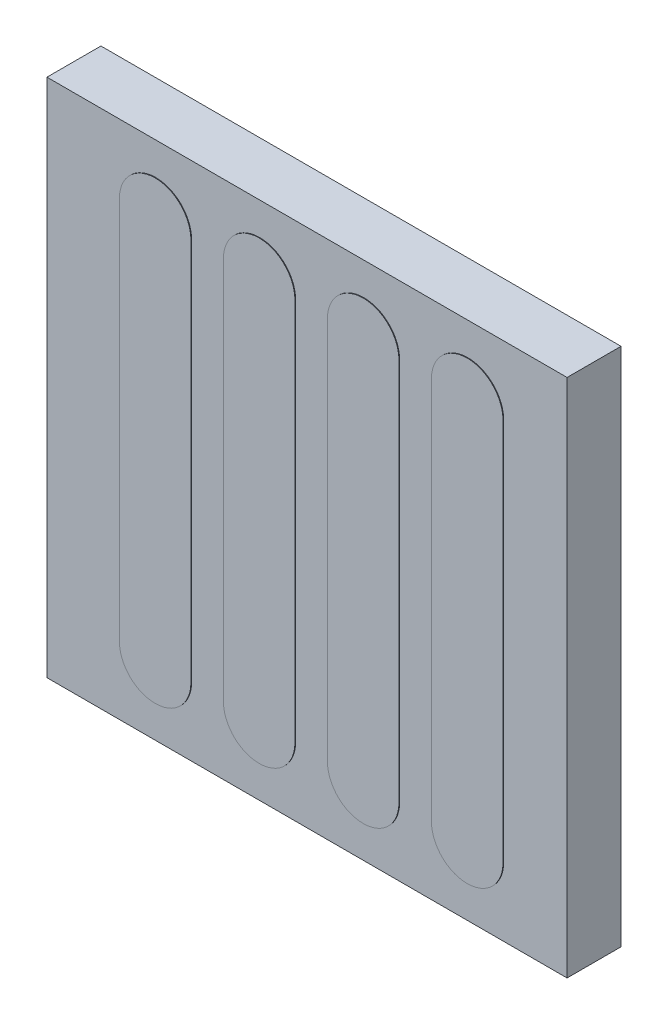
ISO-10303-21;
HEADER;
FILE_DESCRIPTION(('STEP AP214'),'2;1');
FILE_NAME('part.step','',(''),(''),'','','');
FILE_SCHEMA(('AUTOMOTIVE_DESIGN { 1 0 10303 214 1 1 1 1 }'));
ENDSEC;
DATA;
#1=APPLICATION_CONTEXT('core data for automotive mechanical design processes');
#2=APPLICATION_PROTOCOL_DEFINITION('international standard','automotive_design',2000,#1);
#3=PRODUCT_CONTEXT('',#1,'mechanical');
#4=PRODUCT('Part','Part','',(#3));
#5=PRODUCT_RELATED_PRODUCT_CATEGORY('part','',(#4));
#6=PRODUCT_DEFINITION_FORMATION('','',#4);
#7=PRODUCT_DEFINITION_CONTEXT('part definition',#1,'design');
#8=PRODUCT_DEFINITION('design','',#6,#7);
#9=PRODUCT_DEFINITION_SHAPE('','',#8);
#10=(LENGTH_UNIT() NAMED_UNIT(*) SI_UNIT(.MILLI.,.METRE.));
#11=(NAMED_UNIT(*) PLANE_ANGLE_UNIT() SI_UNIT($,.RADIAN.));
#12=(NAMED_UNIT(*) SI_UNIT($,.STERADIAN.) SOLID_ANGLE_UNIT());
#13=UNCERTAINTY_MEASURE_WITH_UNIT(LENGTH_MEASURE(1.E-05),#10,'distance_accuracy_value','');
#14=(GEOMETRIC_REPRESENTATION_CONTEXT(3) GLOBAL_UNCERTAINTY_ASSIGNED_CONTEXT((#13)) GLOBAL_UNIT_ASSIGNED_CONTEXT((#10,
#11,#12)) REPRESENTATION_CONTEXT('',''));
#15=CARTESIAN_POINT('',(0.,0.,0.));
#16=DIRECTION('',(0.,0.,1.));
#17=DIRECTION('',(1.,0.,0.));
#18=AXIS2_PLACEMENT_3D('',#15,#16,#17);
#19=CARTESIAN_POINT('',(0.,0.,4.15));
#20=DIRECTION('',(0.,0.,1.));
#21=DIRECTION('',(1.,0.,0.));
#22=AXIS2_PLACEMENT_3D('',#19,#20,#21);
#23=PLANE('',#22);
#24=DIRECTION('',(0.,1.,0.));
#25=VECTOR('',#24,1.);
#26=CARTESIAN_POINT('',(-0.879724952684046,0.,4.15));
#27=LINE('',#26,#25);
#28=CARTESIAN_POINT('',(-0.879724952684045,-14.75,4.15));
#29=VERTEX_POINT('',#28);
#30=CARTESIAN_POINT('',(-0.879724952684045,14.75,4.15));
#31=VERTEX_POINT('',#30);
#32=EDGE_CURVE('E179',#29,#31,#27,.T.);
#33=ORIENTED_EDGE('',*,*,#32,.F.);
#34=CARTESIAN_POINT('',(-3.62972495268405,-14.75,4.15));
#35=DIRECTION('',(0.,0.,1.));
#36=DIRECTION('',(1.,0.,0.));
#37=AXIS2_PLACEMENT_3D('',#34,#35,#36);
#38=CIRCLE('',#37,2.75000000000001);
#39=CARTESIAN_POINT('',(-6.37972495268406,-14.75,4.15));
#40=VERTEX_POINT('',#39);
#41=EDGE_CURVE('E196',#29,#40,#38,.F.);
#42=ORIENTED_EDGE('',*,*,#41,.T.);
#43=DIRECTION('',(0.,1.,0.));
#44=VECTOR('',#43,1.);
#45=CARTESIAN_POINT('',(-6.37972495268406,0.,4.15));
#46=LINE('',#45,#44);
#47=CARTESIAN_POINT('',(-6.37972495268406,14.75,4.15));
#48=VERTEX_POINT('',#47);
#49=EDGE_CURVE('E199',#40,#48,#46,.T.);
#50=ORIENTED_EDGE('',*,*,#49,.T.);
#51=CARTESIAN_POINT('',(-3.62972495268405,14.75,4.15));
#52=DIRECTION('',(0.,0.,1.));
#53=DIRECTION('',(1.,0.,0.));
#54=AXIS2_PLACEMENT_3D('',#51,#52,#53);
#55=CIRCLE('',#54,2.75000000000001);
#56=EDGE_CURVE('E206',#48,#31,#55,.F.);
#57=ORIENTED_EDGE('',*,*,#56,.T.);
#58=EDGE_LOOP('',(#33,#42,#50,#57));
#59=FACE_BOUND('',#58,.T.);
#60=DIRECTION('',(0.,1.,0.));
#61=VECTOR('',#60,1.);
#62=CARTESIAN_POINT('',(7.12027504731595,0.,4.15));
#63=LINE('',#62,#61);
#64=CARTESIAN_POINT('',(7.12027504731595,-14.75,4.15));
#65=VERTEX_POINT('',#64);
#66=CARTESIAN_POINT('',(7.12027504731595,14.75,4.15));
#67=VERTEX_POINT('',#66);
#68=EDGE_CURVE('E237',#65,#67,#63,.T.);
#69=ORIENTED_EDGE('',*,*,#68,.F.);
#70=CARTESIAN_POINT('',(4.37027504731595,-14.75,4.15));
#71=DIRECTION('',(0.,0.,1.));
#72=DIRECTION('',(1.,0.,0.));
#73=AXIS2_PLACEMENT_3D('',#70,#71,#72);
#74=CIRCLE('',#73,2.75);
#75=CARTESIAN_POINT('',(1.62027504731595,-14.75,4.15));
#76=VERTEX_POINT('',#75);
#77=EDGE_CURVE('E228',#65,#76,#74,.F.);
#78=ORIENTED_EDGE('',*,*,#77,.T.);
#79=DIRECTION('',(0.,1.,0.));
#80=VECTOR('',#79,1.);
#81=CARTESIAN_POINT('',(1.62027504731595,0.,4.15));
#82=LINE('',#81,#80);
#83=CARTESIAN_POINT('',(1.62027504731595,14.75,4.15));
#84=VERTEX_POINT('',#83);
#85=EDGE_CURVE('E231',#76,#84,#82,.T.);
#86=ORIENTED_EDGE('',*,*,#85,.T.);
#87=CARTESIAN_POINT('',(4.37027504731595,14.75,4.15));
#88=DIRECTION('',(0.,0.,1.));
#89=DIRECTION('',(1.,0.,0.));
#90=AXIS2_PLACEMENT_3D('',#87,#88,#89);
#91=CIRCLE('',#90,2.75);
#92=EDGE_CURVE('E234',#84,#67,#91,.F.);
#93=ORIENTED_EDGE('',*,*,#92,.T.);
#94=EDGE_LOOP('',(#69,#78,#86,#93));
#95=FACE_BOUND('',#94,.T.);
#96=DIRECTION('',(0.,-1.,0.));
#97=VECTOR('',#96,1.);
#98=CARTESIAN_POINT('',(9.62027504731594,0.,4.15));
#99=LINE('',#98,#97);
#100=CARTESIAN_POINT('',(9.62027504731594,14.75,4.15));
#101=VERTEX_POINT('',#100);
#102=CARTESIAN_POINT('',(9.62027504731594,-14.75,4.15));
#103=VERTEX_POINT('',#102);
#104=EDGE_CURVE('E307',#101,#103,#99,.T.);
#105=ORIENTED_EDGE('',*,*,#104,.F.);
#106=CARTESIAN_POINT('',(12.3702750473159,14.75,4.15));
#107=DIRECTION('',(0.,0.,1.));
#108=DIRECTION('',(1.,0.,0.));
#109=AXIS2_PLACEMENT_3D('',#106,#107,#108);
#110=CIRCLE('',#109,2.75000000000001);
#111=CARTESIAN_POINT('',(15.120275047316,14.75,4.15));
#112=VERTEX_POINT('',#111);
#113=EDGE_CURVE('E11',#112,#101,#110,.T.);
#114=ORIENTED_EDGE('',*,*,#113,.F.);
#115=DIRECTION('',(0.,-1.,0.));
#116=VECTOR('',#115,1.);
#117=CARTESIAN_POINT('',(15.120275047316,0.,4.15));
#118=LINE('',#117,#116);
#119=CARTESIAN_POINT('',(15.120275047316,-14.75,4.15));
#120=VERTEX_POINT('',#119);
#121=EDGE_CURVE('E302',#112,#120,#118,.T.);
#122=ORIENTED_EDGE('',*,*,#121,.T.);
#123=CARTESIAN_POINT('',(12.3702750473159,-14.75,4.15));
#124=DIRECTION('',(0.,0.,1.));
#125=DIRECTION('',(1.,0.,0.));
#126=AXIS2_PLACEMENT_3D('',#123,#124,#125);
#127=CIRCLE('',#126,2.75000000000001);
#128=EDGE_CURVE('E304',#103,#120,#127,.T.);
#129=ORIENTED_EDGE('',*,*,#128,.F.);
#130=EDGE_LOOP('',(#105,#114,#122,#129));
#131=FACE_BOUND('',#130,.T.);
#132=DIRECTION('',(0.,1.,0.));
#133=VECTOR('',#132,1.);
#134=CARTESIAN_POINT('',(20.,20.,4.15));
#135=LINE('',#134,#133);
#136=CARTESIAN_POINT('',(20.,-20.,4.15));
#137=VERTEX_POINT('',#136);
#138=CARTESIAN_POINT('',(20.,20.,4.15));
#139=VERTEX_POINT('',#138);
#140=EDGE_CURVE('E273',#137,#139,#135,.T.);
#141=ORIENTED_EDGE('',*,*,#140,.T.);
#142=DIRECTION('',(-1.,0.,0.));
#143=VECTOR('',#142,1.);
#144=CARTESIAN_POINT('',(-20.,20.,4.15));
#145=LINE('',#144,#143);
#146=CARTESIAN_POINT('',(-20.,20.,4.15));
#147=VERTEX_POINT('',#146);
#148=EDGE_CURVE('E276',#139,#147,#145,.T.);
#149=ORIENTED_EDGE('',*,*,#148,.T.);
#150=DIRECTION('',(0.,-1.,0.));
#151=VECTOR('',#150,1.);
#152=CARTESIAN_POINT('',(-20.,20.,4.15));
#153=LINE('',#152,#151);
#154=CARTESIAN_POINT('',(-20.,-20.,4.15));
#155=VERTEX_POINT('',#154);
#156=EDGE_CURVE('E279',#147,#155,#153,.T.);
#157=ORIENTED_EDGE('',*,*,#156,.T.);
#158=DIRECTION('',(1.,0.,0.));
#159=VECTOR('',#158,1.);
#160=CARTESIAN_POINT('',(-20.,-20.,4.15));
#161=LINE('',#160,#159);
#162=EDGE_CURVE('E281',#155,#137,#161,.T.);
#163=ORIENTED_EDGE('',*,*,#162,.T.);
#164=EDGE_LOOP('',(#141,#149,#157,#163));
#165=FACE_BOUND('',#164,.T.);
#166=CARTESIAN_POINT('',(-11.6297249526841,-14.75,4.15));
#167=DIRECTION('',(0.,0.,1.));
#168=DIRECTION('',(1.,0.,0.));
#169=AXIS2_PLACEMENT_3D('',#166,#167,#168);
#170=CIRCLE('',#169,2.75000000000001);
#171=CARTESIAN_POINT('',(-8.87972495268404,-14.75,4.15));
#172=VERTEX_POINT('',#171);
#173=CARTESIAN_POINT('',(-14.3797249526841,-14.75,4.15));
#174=VERTEX_POINT('',#173);
#175=EDGE_CURVE('E266',#172,#174,#170,.F.);
#176=ORIENTED_EDGE('',*,*,#175,.T.);
#177=DIRECTION('',(0.,1.,0.));
#178=VECTOR('',#177,1.);
#179=CARTESIAN_POINT('',(-14.3797249526841,0.,4.15));
#180=LINE('',#179,#178);
#181=CARTESIAN_POINT('',(-14.3797249526841,14.75,4.15));
#182=VERTEX_POINT('',#181);
#183=EDGE_CURVE('E269',#174,#182,#180,.T.);
#184=ORIENTED_EDGE('',*,*,#183,.T.);
#185=CARTESIAN_POINT('',(-11.6297249526841,14.75,4.15));
#186=DIRECTION('',(0.,0.,1.));
#187=DIRECTION('',(1.,0.,0.));
#188=AXIS2_PLACEMENT_3D('',#185,#186,#187);
#189=CIRCLE('',#188,2.75000000000001);
#190=CARTESIAN_POINT('',(-8.87972495268404,14.75,4.15));
#191=VERTEX_POINT('',#190);
#192=EDGE_CURVE('E260',#182,#191,#189,.F.);
#193=ORIENTED_EDGE('',*,*,#192,.T.);
#194=DIRECTION('',(0.,1.,0.));
#195=VECTOR('',#194,1.);
#196=CARTESIAN_POINT('',(-8.87972495268405,0.,4.15));
#197=LINE('',#196,#195);
#198=EDGE_CURVE('E263',#172,#191,#197,.T.);
#199=ORIENTED_EDGE('',*,*,#198,.F.);
#200=EDGE_LOOP('',(#176,#184,#193,#199));
#201=FACE_BOUND('',#200,.T.);
#202=ADVANCED_FACE('F33',(#59,#95,#131,#165,#201),#23,.T.);
#203=CARTESIAN_POINT('',(9.62027504731594,0.,4.2));
#204=DIRECTION('',(1.,0.,0.));
#205=DIRECTION('',(0.,1.,0.));
#206=AXIS2_PLACEMENT_3D('',#203,#204,#205);
#207=PLANE('',#206);
#208=DIRECTION('',(0.,0.,-1.));
#209=VECTOR('',#208,1.);
#210=CARTESIAN_POINT('',(9.62027504731594,14.75,4.2));
#211=LINE('',#210,#209);
#212=CARTESIAN_POINT('',(9.62027504731594,14.75,4.2));
#213=VERTEX_POINT('',#212);
#214=EDGE_CURVE('E320',#213,#101,#211,.T.);
#215=ORIENTED_EDGE('',*,*,#214,.T.);
#216=ORIENTED_EDGE('',*,*,#104,.T.);
#217=DIRECTION('',(0.,0.,-1.));
#218=VECTOR('',#217,1.);
#219=CARTESIAN_POINT('',(9.62027504731594,-14.75,4.2));
#220=LINE('',#219,#218);
#221=CARTESIAN_POINT('',(9.62027504731594,-14.75,4.2));
#222=VERTEX_POINT('',#221);
#223=EDGE_CURVE('E41',#222,#103,#220,.T.);
#224=ORIENTED_EDGE('',*,*,#223,.F.);
#225=DIRECTION('',(0.,-1.,0.));
#226=VECTOR('',#225,1.);
#227=CARTESIAN_POINT('',(9.62027504731594,0.,4.2));
#228=LINE('',#227,#226);
#229=EDGE_CURVE('E310',#213,#222,#228,.T.);
#230=ORIENTED_EDGE('',*,*,#229,.F.);
#231=EDGE_LOOP('',(#215,#216,#224,#230));
#232=FACE_BOUND('',#231,.T.);
#233=ADVANCED_FACE('F35',(#232),#207,.F.);
#234=CARTESIAN_POINT('',(12.3702750473159,-14.75,4.2));
#235=DIRECTION('',(0.,0.,-1.));
#236=DIRECTION('',(-1.,0.,0.));
#237=AXIS2_PLACEMENT_3D('',#234,#235,#236);
#238=CYLINDRICAL_SURFACE('',#237,2.75000000000001);
#239=ORIENTED_EDGE('',*,*,#223,.T.);
#240=ORIENTED_EDGE('',*,*,#128,.T.);
#241=DIRECTION('',(0.,0.,-1.));
#242=VECTOR('',#241,1.);
#243=CARTESIAN_POINT('',(15.120275047316,-14.75,4.2));
#244=LINE('',#243,#242);
#245=CARTESIAN_POINT('',(15.120275047316,-14.75,4.2));
#246=VERTEX_POINT('',#245);
#247=EDGE_CURVE('E326',#246,#120,#244,.T.);
#248=ORIENTED_EDGE('',*,*,#247,.F.);
#249=CARTESIAN_POINT('',(12.3702750473159,-14.75,4.2));
#250=DIRECTION('',(0.,0.,1.));
#251=DIRECTION('',(1.,0.,0.));
#252=AXIS2_PLACEMENT_3D('',#249,#250,#251);
#253=CIRCLE('',#252,2.75000000000001);
#254=EDGE_CURVE('E313',#222,#246,#253,.T.);
#255=ORIENTED_EDGE('',*,*,#254,.F.);
#256=EDGE_LOOP('',(#239,#240,#248,#255));
#257=FACE_BOUND('',#256,.T.);
#258=ADVANCED_FACE('F331',(#257),#238,.T.);
#259=CARTESIAN_POINT('',(15.120275047316,0.,4.2));
#260=DIRECTION('',(1.,0.,0.));
#261=DIRECTION('',(0.,1.,0.));
#262=AXIS2_PLACEMENT_3D('',#259,#260,#261);
#263=PLANE('',#262);
#264=ORIENTED_EDGE('',*,*,#121,.F.);
#265=DIRECTION('',(0.,0.,-1.));
#266=VECTOR('',#265,1.);
#267=CARTESIAN_POINT('',(15.120275047316,14.75,4.2));
#268=LINE('',#267,#266);
#269=CARTESIAN_POINT('',(15.120275047316,14.75,4.2));
#270=VERTEX_POINT('',#269);
#271=EDGE_CURVE('E323',#270,#112,#268,.T.);
#272=ORIENTED_EDGE('',*,*,#271,.F.);
#273=DIRECTION('',(0.,-1.,0.));
#274=VECTOR('',#273,1.);
#275=CARTESIAN_POINT('',(15.120275047316,0.,4.2));
#276=LINE('',#275,#274);
#277=EDGE_CURVE('E315',#270,#246,#276,.T.);
#278=ORIENTED_EDGE('',*,*,#277,.T.);
#279=ORIENTED_EDGE('',*,*,#247,.T.);
#280=EDGE_LOOP('',(#264,#272,#278,#279));
#281=FACE_BOUND('',#280,.T.);
#282=ADVANCED_FACE('F344',(#281),#263,.T.);
#283=CARTESIAN_POINT('',(12.3702750473159,14.75,4.2));
#284=DIRECTION('',(0.,0.,-1.));
#285=DIRECTION('',(-1.,0.,0.));
#286=AXIS2_PLACEMENT_3D('',#283,#284,#285);
#287=CYLINDRICAL_SURFACE('',#286,2.75000000000001);
#288=ORIENTED_EDGE('',*,*,#271,.T.);
#289=ORIENTED_EDGE('',*,*,#113,.T.);
#290=ORIENTED_EDGE('',*,*,#214,.F.);
#291=CARTESIAN_POINT('',(12.3702750473159,14.75,4.2));
#292=DIRECTION('',(0.,0.,1.));
#293=DIRECTION('',(1.,0.,0.));
#294=AXIS2_PLACEMENT_3D('',#291,#292,#293);
#295=CIRCLE('',#294,2.75000000000001);
#296=EDGE_CURVE('E318',#270,#213,#295,.T.);
#297=ORIENTED_EDGE('',*,*,#296,.F.);
#298=EDGE_LOOP('',(#288,#289,#290,#297));
#299=FACE_BOUND('',#298,.T.);
#300=ADVANCED_FACE('F340',(#299),#287,.T.);
#301=CARTESIAN_POINT('',(0.,0.,4.2));
#302=DIRECTION('',(0.,0.,1.));
#303=DIRECTION('',(1.,0.,0.));
#304=AXIS2_PLACEMENT_3D('',#301,#302,#303);
#305=PLANE('',#304);
#306=ORIENTED_EDGE('',*,*,#229,.T.);
#307=ORIENTED_EDGE('',*,*,#254,.T.);
#308=ORIENTED_EDGE('',*,*,#277,.F.);
#309=ORIENTED_EDGE('',*,*,#296,.T.);
#310=EDGE_LOOP('',(#306,#307,#308,#309));
#311=FACE_BOUND('',#310,.T.);
#312=ADVANCED_FACE('F346',(#311),#305,.T.);
#313=CARTESIAN_POINT('',(20.,20.,4.15));
#314=DIRECTION('',(-1.,0.,0.));
#315=DIRECTION('',(0.,-1.,0.));
#316=AXIS2_PLACEMENT_3D('',#313,#314,#315);
#317=PLANE('',#316);
#318=DIRECTION('',(0.,1.,0.));
#319=VECTOR('',#318,1.);
#320=CARTESIAN_POINT('',(20.,20.,0.));
#321=LINE('',#320,#319);
#322=CARTESIAN_POINT('',(20.,-20.,0.));
#323=VERTEX_POINT('',#322);
#324=CARTESIAN_POINT('',(20.,20.,0.));
#325=VERTEX_POINT('',#324);
#326=EDGE_CURVE('E272',#323,#325,#321,.T.);
#327=ORIENTED_EDGE('',*,*,#326,.T.);
#328=DIRECTION('',(0.,0.,-1.));
#329=VECTOR('',#328,1.);
#330=CARTESIAN_POINT('',(20.,20.,4.15));
#331=LINE('',#330,#329);
#332=EDGE_CURVE('E299',#139,#325,#331,.T.);
#333=ORIENTED_EDGE('',*,*,#332,.F.);
#334=ORIENTED_EDGE('',*,*,#140,.F.);
#335=DIRECTION('',(0.,0.,-1.));
#336=VECTOR('',#335,1.);
#337=CARTESIAN_POINT('',(20.,-20.,4.15));
#338=LINE('',#337,#336);
#339=EDGE_CURVE('E283',#137,#323,#338,.T.);
#340=ORIENTED_EDGE('',*,*,#339,.T.);
#341=EDGE_LOOP('',(#327,#333,#334,#340));
#342=FACE_BOUND('',#341,.T.);
#343=ADVANCED_FACE('F348',(#342),#317,.F.);
#344=CARTESIAN_POINT('',(-20.,20.,4.15));
#345=DIRECTION('',(0.,-1.,0.));
#346=DIRECTION('',(0.,0.,-1.));
#347=AXIS2_PLACEMENT_3D('',#344,#345,#346);
#348=PLANE('',#347);
#349=DIRECTION('',(-1.,0.,0.));
#350=VECTOR('',#349,1.);
#351=CARTESIAN_POINT('',(-20.,20.,0.));
#352=LINE('',#351,#350);
#353=CARTESIAN_POINT('',(-20.,20.,0.));
#354=VERTEX_POINT('',#353);
#355=EDGE_CURVE('E286',#325,#354,#352,.T.);
#356=ORIENTED_EDGE('',*,*,#355,.T.);
#357=DIRECTION('',(0.,0.,-1.));
#358=VECTOR('',#357,1.);
#359=CARTESIAN_POINT('',(-20.,20.,4.15));
#360=LINE('',#359,#358);
#361=EDGE_CURVE('E296',#147,#354,#360,.T.);
#362=ORIENTED_EDGE('',*,*,#361,.F.);
#363=ORIENTED_EDGE('',*,*,#148,.F.);
#364=ORIENTED_EDGE('',*,*,#332,.T.);
#365=EDGE_LOOP('',(#356,#362,#363,#364));
#366=FACE_BOUND('',#365,.T.);
#367=ADVANCED_FACE('F354',(#366),#348,.F.);
#368=CARTESIAN_POINT('',(-20.,20.,4.15));
#369=DIRECTION('',(1.,0.,0.));
#370=DIRECTION('',(0.,1.,0.));
#371=AXIS2_PLACEMENT_3D('',#368,#369,#370);
#372=PLANE('',#371);
#373=DIRECTION('',(0.,-1.,0.));
#374=VECTOR('',#373,1.);
#375=CARTESIAN_POINT('',(-20.,20.,0.));
#376=LINE('',#375,#374);
#377=CARTESIAN_POINT('',(-20.,-20.,0.));
#378=VERTEX_POINT('',#377);
#379=EDGE_CURVE('E288',#354,#378,#376,.T.);
#380=ORIENTED_EDGE('',*,*,#379,.T.);
#381=DIRECTION('',(0.,0.,-1.));
#382=VECTOR('',#381,1.);
#383=CARTESIAN_POINT('',(-20.,-20.,4.15));
#384=LINE('',#383,#382);
#385=EDGE_CURVE('E293',#155,#378,#384,.T.);
#386=ORIENTED_EDGE('',*,*,#385,.F.);
#387=ORIENTED_EDGE('',*,*,#156,.F.);
#388=ORIENTED_EDGE('',*,*,#361,.T.);
#389=EDGE_LOOP('',(#380,#386,#387,#388));
#390=FACE_BOUND('',#389,.T.);
#391=ADVANCED_FACE('F374',(#390),#372,.F.);
#392=CARTESIAN_POINT('',(-20.,-20.,4.15));
#393=DIRECTION('',(0.,1.,0.));
#394=DIRECTION('',(0.,0.,1.));
#395=AXIS2_PLACEMENT_3D('',#392,#393,#394);
#396=PLANE('',#395);
#397=DIRECTION('',(1.,0.,0.));
#398=VECTOR('',#397,1.);
#399=CARTESIAN_POINT('',(-20.,-20.,0.));
#400=LINE('',#399,#398);
#401=EDGE_CURVE('E277',#378,#323,#400,.T.);
#402=ORIENTED_EDGE('',*,*,#401,.T.);
#403=ORIENTED_EDGE('',*,*,#339,.F.);
#404=ORIENTED_EDGE('',*,*,#162,.F.);
#405=ORIENTED_EDGE('',*,*,#385,.T.);
#406=EDGE_LOOP('',(#402,#403,#404,#405));
#407=FACE_BOUND('',#406,.T.);
#408=ADVANCED_FACE('F370',(#407),#396,.F.);
#409=CARTESIAN_POINT('',(0.,0.,0.));
#410=DIRECTION('',(0.,0.,1.));
#411=DIRECTION('',(1.,0.,0.));
#412=AXIS2_PLACEMENT_3D('',#409,#410,#411);
#413=PLANE('',#412);
#414=ORIENTED_EDGE('',*,*,#326,.F.);
#415=ORIENTED_EDGE('',*,*,#401,.F.);
#416=ORIENTED_EDGE('',*,*,#379,.F.);
#417=ORIENTED_EDGE('',*,*,#355,.F.);
#418=EDGE_LOOP('',(#414,#415,#416,#417));
#419=FACE_BOUND('',#418,.T.);
#420=ADVANCED_FACE('F373',(#419),#413,.F.);
#421=CARTESIAN_POINT('',(-14.3797249526841,0.,4.2));
#422=DIRECTION('',(1.,0.,0.));
#423=DIRECTION('',(0.,1.,0.));
#424=AXIS2_PLACEMENT_3D('',#421,#422,#423);
#425=PLANE('',#424);
#426=ORIENTED_EDGE('',*,*,#183,.F.);
#427=DIRECTION('',(0.,0.,-1.));
#428=VECTOR('',#427,1.);
#429=CARTESIAN_POINT('',(-14.3797249526841,-14.75,4.2));
#430=LINE('',#429,#428);
#431=CARTESIAN_POINT('',(-14.3797249526841,-14.75,4.2));
#432=VERTEX_POINT('',#431);
#433=EDGE_CURVE('E239',#432,#174,#430,.T.);
#434=ORIENTED_EDGE('',*,*,#433,.F.);
#435=DIRECTION('',(0.,-1.,0.));
#436=VECTOR('',#435,1.);
#437=CARTESIAN_POINT('',(-14.3797249526841,0.,4.2));
#438=LINE('',#437,#436);
#439=CARTESIAN_POINT('',(-14.3797249526841,14.75,4.2));
#440=VERTEX_POINT('',#439);
#441=EDGE_CURVE('E257',#440,#432,#438,.T.);
#442=ORIENTED_EDGE('',*,*,#441,.F.);
#443=DIRECTION('',(0.,0.,-1.));
#444=VECTOR('',#443,1.);
#445=CARTESIAN_POINT('',(-14.3797249526841,14.75,4.2));
#446=LINE('',#445,#444);
#447=EDGE_CURVE('E247',#440,#182,#446,.T.);
#448=ORIENTED_EDGE('',*,*,#447,.T.);
#449=EDGE_LOOP('',(#426,#434,#442,#448));
#450=FACE_BOUND('',#449,.T.);
#451=ADVANCED_FACE('F408',(#450),#425,.F.);
#452=CARTESIAN_POINT('',(-11.6297249526841,-14.75,4.2));
#453=DIRECTION('',(0.,0.,-1.));
#454=DIRECTION('',(-1.,0.,0.));
#455=AXIS2_PLACEMENT_3D('',#452,#453,#454);
#456=CYLINDRICAL_SURFACE('',#455,2.75000000000001);
#457=ORIENTED_EDGE('',*,*,#175,.F.);
#458=DIRECTION('',(0.,0.,-1.));
#459=VECTOR('',#458,1.);
#460=CARTESIAN_POINT('',(-8.87972495268404,-14.75,4.2));
#461=LINE('',#460,#459);
#462=CARTESIAN_POINT('',(-8.87972495268404,-14.75,4.2));
#463=VERTEX_POINT('',#462);
#464=EDGE_CURVE('E242',#463,#172,#461,.T.);
#465=ORIENTED_EDGE('',*,*,#464,.F.);
#466=CARTESIAN_POINT('',(-11.6297249526841,-14.75,4.2));
#467=DIRECTION('',(0.,0.,1.));
#468=DIRECTION('',(1.,0.,0.));
#469=AXIS2_PLACEMENT_3D('',#466,#467,#468);
#470=CIRCLE('',#469,2.75000000000001);
#471=EDGE_CURVE('E255',#432,#463,#470,.T.);
#472=ORIENTED_EDGE('',*,*,#471,.F.);
#473=ORIENTED_EDGE('',*,*,#433,.T.);
#474=EDGE_LOOP('',(#457,#465,#472,#473));
#475=FACE_BOUND('',#474,.T.);
#476=ADVANCED_FACE('F398',(#475),#456,.T.);
#477=CARTESIAN_POINT('',(-8.87972495268405,0.,4.2));
#478=DIRECTION('',(1.,0.,0.));
#479=DIRECTION('',(0.,1.,0.));
#480=AXIS2_PLACEMENT_3D('',#477,#478,#479);
#481=PLANE('',#480);
#482=ORIENTED_EDGE('',*,*,#464,.T.);
#483=ORIENTED_EDGE('',*,*,#198,.T.);
#484=DIRECTION('',(0.,0.,-1.));
#485=VECTOR('',#484,1.);
#486=CARTESIAN_POINT('',(-8.87972495268405,14.75,4.2));
#487=LINE('',#486,#485);
#488=CARTESIAN_POINT('',(-8.87972495268405,14.75,4.2));
#489=VERTEX_POINT('',#488);
#490=EDGE_CURVE('E245',#489,#191,#487,.T.);
#491=ORIENTED_EDGE('',*,*,#490,.F.);
#492=DIRECTION('',(0.,-1.,0.));
#493=VECTOR('',#492,1.);
#494=CARTESIAN_POINT('',(-8.87972495268405,0.,4.2));
#495=LINE('',#494,#493);
#496=EDGE_CURVE('E252',#489,#463,#495,.T.);
#497=ORIENTED_EDGE('',*,*,#496,.T.);
#498=EDGE_LOOP('',(#482,#483,#491,#497));
#499=FACE_BOUND('',#498,.T.);
#500=ADVANCED_FACE('F401',(#499),#481,.T.);
#501=CARTESIAN_POINT('',(-11.6297249526841,14.75,4.2));
#502=DIRECTION('',(0.,0.,-1.));
#503=DIRECTION('',(-1.,0.,0.));
#504=AXIS2_PLACEMENT_3D('',#501,#502,#503);
#505=CYLINDRICAL_SURFACE('',#504,2.75000000000001);
#506=ORIENTED_EDGE('',*,*,#192,.F.);
#507=ORIENTED_EDGE('',*,*,#447,.F.);
#508=CARTESIAN_POINT('',(-11.6297249526841,14.75,4.2));
#509=DIRECTION('',(0.,0.,1.));
#510=DIRECTION('',(1.,0.,0.));
#511=AXIS2_PLACEMENT_3D('',#508,#509,#510);
#512=CIRCLE('',#511,2.75000000000001);
#513=EDGE_CURVE('E250',#489,#440,#512,.T.);
#514=ORIENTED_EDGE('',*,*,#513,.F.);
#515=ORIENTED_EDGE('',*,*,#490,.T.);
#516=EDGE_LOOP('',(#506,#507,#514,#515));
#517=FACE_BOUND('',#516,.T.);
#518=ADVANCED_FACE('F410',(#517),#505,.T.);
#519=CARTESIAN_POINT('',(0.,0.,4.2));
#520=DIRECTION('',(0.,0.,1.));
#521=DIRECTION('',(1.,0.,0.));
#522=AXIS2_PLACEMENT_3D('',#519,#520,#521);
#523=PLANE('',#522);
#524=ORIENTED_EDGE('',*,*,#441,.T.);
#525=ORIENTED_EDGE('',*,*,#471,.T.);
#526=ORIENTED_EDGE('',*,*,#496,.F.);
#527=ORIENTED_EDGE('',*,*,#513,.T.);
#528=EDGE_LOOP('',(#524,#525,#526,#527));
#529=FACE_BOUND('',#528,.T.);
#530=ADVANCED_FACE('F368',(#529),#523,.T.);
#531=CARTESIAN_POINT('',(7.12027504731595,14.75,4.2));
#532=DIRECTION('',(1.,0.,0.));
#533=DIRECTION('',(0.,0.,-1.));
#534=AXIS2_PLACEMENT_3D('',#531,#532,#533);
#535=PLANE('',#534);
#536=DIRECTION('',(0.,0.,-1.));
#537=VECTOR('',#536,1.);
#538=CARTESIAN_POINT('',(7.12027504731595,-14.75,4.2));
#539=LINE('',#538,#537);
#540=CARTESIAN_POINT('',(7.12027504731595,-14.75,4.2));
#541=VERTEX_POINT('',#540);
#542=EDGE_CURVE('E210',#541,#65,#539,.T.);
#543=ORIENTED_EDGE('',*,*,#542,.T.);
#544=ORIENTED_EDGE('',*,*,#68,.T.);
#545=DIRECTION('',(0.,0.,-1.));
#546=VECTOR('',#545,1.);
#547=CARTESIAN_POINT('',(7.12027504731595,14.75,4.2));
#548=LINE('',#547,#546);
#549=CARTESIAN_POINT('',(7.12027504731595,14.75,4.2));
#550=VERTEX_POINT('',#549);
#551=EDGE_CURVE('E209',#550,#67,#548,.T.);
#552=ORIENTED_EDGE('',*,*,#551,.F.);
#553=DIRECTION('',(0.,-1.,0.));
#554=VECTOR('',#553,1.);
#555=CARTESIAN_POINT('',(7.12027504731595,14.75,4.2));
#556=LINE('',#555,#554);
#557=EDGE_CURVE('E225',#550,#541,#556,.T.);
#558=ORIENTED_EDGE('',*,*,#557,.T.);
#559=EDGE_LOOP('',(#543,#544,#552,#558));
#560=FACE_BOUND('',#559,.T.);
#561=ADVANCED_FACE('F416',(#560),#535,.T.);
#562=CARTESIAN_POINT('',(4.37027504731595,14.75,4.2));
#563=DIRECTION('',(0.,0.,-1.));
#564=DIRECTION('',(-1.,0.,0.));
#565=AXIS2_PLACEMENT_3D('',#562,#563,#564);
#566=CYLINDRICAL_SURFACE('',#565,2.75);
#567=ORIENTED_EDGE('',*,*,#92,.F.);
#568=DIRECTION('',(0.,0.,-1.));
#569=VECTOR('',#568,1.);
#570=CARTESIAN_POINT('',(1.62027504731595,14.75,4.2));
#571=LINE('',#570,#569);
#572=CARTESIAN_POINT('',(1.62027504731595,14.75,4.2));
#573=VERTEX_POINT('',#572);
#574=EDGE_CURVE('E215',#573,#84,#571,.T.);
#575=ORIENTED_EDGE('',*,*,#574,.F.);
#576=CARTESIAN_POINT('',(4.37027504731595,14.75,4.2));
#577=DIRECTION('',(0.,0.,1.));
#578=DIRECTION('',(1.,0.,0.));
#579=AXIS2_PLACEMENT_3D('',#576,#577,#578);
#580=CIRCLE('',#579,2.75);
#581=EDGE_CURVE('E213',#550,#573,#580,.T.);
#582=ORIENTED_EDGE('',*,*,#581,.F.);
#583=ORIENTED_EDGE('',*,*,#551,.T.);
#584=EDGE_LOOP('',(#567,#575,#582,#583));
#585=FACE_BOUND('',#584,.T.);
#586=ADVANCED_FACE('F428',(#585),#566,.T.);
#587=CARTESIAN_POINT('',(1.62027504731595,14.75,4.2));
#588=DIRECTION('',(1.,0.,0.));
#589=DIRECTION('',(0.,0.,-1.));
#590=AXIS2_PLACEMENT_3D('',#587,#588,#589);
#591=PLANE('',#590);
#592=ORIENTED_EDGE('',*,*,#85,.F.);
#593=DIRECTION('',(0.,0.,-1.));
#594=VECTOR('',#593,1.);
#595=CARTESIAN_POINT('',(1.62027504731595,-14.75,4.2));
#596=LINE('',#595,#594);
#597=CARTESIAN_POINT('',(1.62027504731595,-14.75,4.2));
#598=VERTEX_POINT('',#597);
#599=EDGE_CURVE('E56',#598,#76,#596,.T.);
#600=ORIENTED_EDGE('',*,*,#599,.F.);
#601=DIRECTION('',(0.,-1.,0.));
#602=VECTOR('',#601,1.);
#603=CARTESIAN_POINT('',(1.62027504731595,14.75,4.2));
#604=LINE('',#603,#602);
#605=EDGE_CURVE('E221',#573,#598,#604,.T.);
#606=ORIENTED_EDGE('',*,*,#605,.F.);
#607=ORIENTED_EDGE('',*,*,#574,.T.);
#608=EDGE_LOOP('',(#592,#600,#606,#607));
#609=FACE_BOUND('',#608,.T.);
#610=ADVANCED_FACE('F431',(#609),#591,.F.);
#611=CARTESIAN_POINT('',(4.37027504731595,-14.75,4.2));
#612=DIRECTION('',(0.,0.,-1.));
#613=DIRECTION('',(-1.,0.,0.));
#614=AXIS2_PLACEMENT_3D('',#611,#612,#613);
#615=CYLINDRICAL_SURFACE('',#614,2.75);
#616=ORIENTED_EDGE('',*,*,#77,.F.);
#617=ORIENTED_EDGE('',*,*,#542,.F.);
#618=CARTESIAN_POINT('',(4.37027504731595,-14.75,4.2));
#619=DIRECTION('',(0.,0.,1.));
#620=DIRECTION('',(1.,0.,0.));
#621=AXIS2_PLACEMENT_3D('',#618,#619,#620);
#622=CIRCLE('',#621,2.75);
#623=EDGE_CURVE('E223',#598,#541,#622,.T.);
#624=ORIENTED_EDGE('',*,*,#623,.F.);
#625=ORIENTED_EDGE('',*,*,#599,.T.);
#626=EDGE_LOOP('',(#616,#617,#624,#625));
#627=FACE_BOUND('',#626,.T.);
#628=ADVANCED_FACE('F426',(#627),#615,.T.);
#629=CARTESIAN_POINT('',(4.37027504731595,-14.75,4.2));
#630=DIRECTION('',(0.,0.,1.));
#631=DIRECTION('',(1.,0.,0.));
#632=AXIS2_PLACEMENT_3D('',#629,#630,#631);
#633=PLANE('',#632);
#634=ORIENTED_EDGE('',*,*,#557,.F.);
#635=ORIENTED_EDGE('',*,*,#581,.T.);
#636=ORIENTED_EDGE('',*,*,#605,.T.);
#637=ORIENTED_EDGE('',*,*,#623,.T.);
#638=EDGE_LOOP('',(#634,#635,#636,#637));
#639=FACE_BOUND('',#638,.T.);
#640=ADVANCED_FACE('F423',(#639),#633,.T.);
#641=CARTESIAN_POINT('',(-0.879724952684048,14.75,4.2));
#642=DIRECTION('',(1.,0.,0.));
#643=DIRECTION('',(0.,1.,0.));
#644=AXIS2_PLACEMENT_3D('',#641,#642,#643);
#645=PLANE('',#644);
#646=DIRECTION('',(0.,0.,-1.));
#647=VECTOR('',#646,1.);
#648=CARTESIAN_POINT('',(-0.879724952684045,-14.75,4.2));
#649=LINE('',#648,#647);
#650=CARTESIAN_POINT('',(-0.879724952684045,-14.75,4.2));
#651=VERTEX_POINT('',#650);
#652=EDGE_CURVE('E191',#651,#29,#649,.T.);
#653=ORIENTED_EDGE('',*,*,#652,.T.);
#654=ORIENTED_EDGE('',*,*,#32,.T.);
#655=DIRECTION('',(0.,0.,-1.));
#656=VECTOR('',#655,1.);
#657=CARTESIAN_POINT('',(-0.879724952684045,14.75,4.2));
#658=LINE('',#657,#656);
#659=CARTESIAN_POINT('',(-0.879724952684045,14.75,4.2));
#660=VERTEX_POINT('',#659);
#661=EDGE_CURVE('E172',#660,#31,#658,.T.);
#662=ORIENTED_EDGE('',*,*,#661,.F.);
#663=DIRECTION('',(0.,-1.,0.));
#664=VECTOR('',#663,1.);
#665=CARTESIAN_POINT('',(-0.879724952684048,14.75,4.2));
#666=LINE('',#665,#664);
#667=EDGE_CURVE('E177',#660,#651,#666,.T.);
#668=ORIENTED_EDGE('',*,*,#667,.T.);
#669=EDGE_LOOP('',(#653,#654,#662,#668));
#670=FACE_BOUND('',#669,.T.);
#671=ADVANCED_FACE('F175',(#670),#645,.T.);
#672=CARTESIAN_POINT('',(-3.62972495268405,14.75,4.2));
#673=DIRECTION('',(0.,0.,-1.));
#674=DIRECTION('',(-1.,0.,0.));
#675=AXIS2_PLACEMENT_3D('',#672,#673,#674);
#676=CYLINDRICAL_SURFACE('',#675,2.75000000000001);
#677=ORIENTED_EDGE('',*,*,#56,.F.);
#678=DIRECTION('',(0.,0.,-1.));
#679=VECTOR('',#678,1.);
#680=CARTESIAN_POINT('',(-6.37972495268406,14.75,4.2));
#681=LINE('',#680,#679);
#682=CARTESIAN_POINT('',(-6.37972495268406,14.75,4.2));
#683=VERTEX_POINT('',#682);
#684=EDGE_CURVE('E182',#683,#48,#681,.T.);
#685=ORIENTED_EDGE('',*,*,#684,.F.);
#686=CARTESIAN_POINT('',(-3.62972495268405,14.75,4.2));
#687=DIRECTION('',(0.,0.,1.));
#688=DIRECTION('',(1.,0.,0.));
#689=AXIS2_PLACEMENT_3D('',#686,#687,#688);
#690=CIRCLE('',#689,2.75000000000001);
#691=EDGE_CURVE('E185',#660,#683,#690,.T.);
#692=ORIENTED_EDGE('',*,*,#691,.F.);
#693=ORIENTED_EDGE('',*,*,#661,.T.);
#694=EDGE_LOOP('',(#677,#685,#692,#693));
#695=FACE_BOUND('',#694,.T.);
#696=ADVANCED_FACE('F186',(#695),#676,.T.);
#697=CARTESIAN_POINT('',(-6.37972495268406,14.75,4.2));
#698=DIRECTION('',(1.,0.,0.));
#699=DIRECTION('',(0.,1.,0.));
#700=AXIS2_PLACEMENT_3D('',#697,#698,#699);
#701=PLANE('',#700);
#702=ORIENTED_EDGE('',*,*,#49,.F.);
#703=DIRECTION('',(0.,0.,-1.));
#704=VECTOR('',#703,1.);
#705=CARTESIAN_POINT('',(-6.37972495268406,-14.75,4.2));
#706=LINE('',#705,#704);
#707=CARTESIAN_POINT('',(-6.37972495268406,-14.75,4.2));
#708=VERTEX_POINT('',#707);
#709=EDGE_CURVE('E48',#708,#40,#706,.T.);
#710=ORIENTED_EDGE('',*,*,#709,.F.);
#711=DIRECTION('',(0.,-1.,0.));
#712=VECTOR('',#711,1.);
#713=CARTESIAN_POINT('',(-6.37972495268406,14.75,4.2));
#714=LINE('',#713,#712);
#715=EDGE_CURVE('E190',#683,#708,#714,.T.);
#716=ORIENTED_EDGE('',*,*,#715,.F.);
#717=ORIENTED_EDGE('',*,*,#684,.T.);
#718=EDGE_LOOP('',(#702,#710,#716,#717));
#719=FACE_BOUND('',#718,.T.);
#720=ADVANCED_FACE('F446',(#719),#701,.F.);
#721=CARTESIAN_POINT('',(-3.62972495268405,-14.75,4.2));
#722=DIRECTION('',(0.,0.,-1.));
#723=DIRECTION('',(-1.,0.,0.));
#724=AXIS2_PLACEMENT_3D('',#721,#722,#723);
#725=CYLINDRICAL_SURFACE('',#724,2.75000000000001);
#726=ORIENTED_EDGE('',*,*,#41,.F.);
#727=ORIENTED_EDGE('',*,*,#652,.F.);
#728=CARTESIAN_POINT('',(-3.62972495268405,-14.75,4.2));
#729=DIRECTION('',(0.,0.,1.));
#730=DIRECTION('',(1.,0.,0.));
#731=AXIS2_PLACEMENT_3D('',#728,#729,#730);
#732=CIRCLE('',#731,2.75000000000001);
#733=EDGE_CURVE('E194',#708,#651,#732,.T.);
#734=ORIENTED_EDGE('',*,*,#733,.F.);
#735=ORIENTED_EDGE('',*,*,#709,.T.);
#736=EDGE_LOOP('',(#726,#727,#734,#735));
#737=FACE_BOUND('',#736,.T.);
#738=ADVANCED_FACE('F443',(#737),#725,.T.);
#739=CARTESIAN_POINT('',(-3.62972495268405,-14.75,4.2));
#740=DIRECTION('',(0.,0.,1.));
#741=DIRECTION('',(1.,0.,0.));
#742=AXIS2_PLACEMENT_3D('',#739,#740,#741);
#743=PLANE('',#742);
#744=ORIENTED_EDGE('',*,*,#667,.F.);
#745=ORIENTED_EDGE('',*,*,#691,.T.);
#746=ORIENTED_EDGE('',*,*,#715,.T.);
#747=ORIENTED_EDGE('',*,*,#733,.T.);
#748=EDGE_LOOP('',(#744,#745,#746,#747));
#749=FACE_BOUND('',#748,.T.);
#750=ADVANCED_FACE('F193',(#749),#743,.T.);
#751=CLOSED_SHELL('',(#202,#233,#258,#282,#300,#312,#343,#367,#391,#408,#420,#451,#476,#500,
#518,#530,#561,#586,#610,#628,#640,#671,#696,#720,#738,#750));
#752=MANIFOLD_SOLID_BREP('B2',#751);
#753=ADVANCED_BREP_SHAPE_REPRESENTATION('',(#18,#752),#14);
#754=SHAPE_DEFINITION_REPRESENTATION(#9,#753);
ENDSEC;
END-ISO-10303-21;
